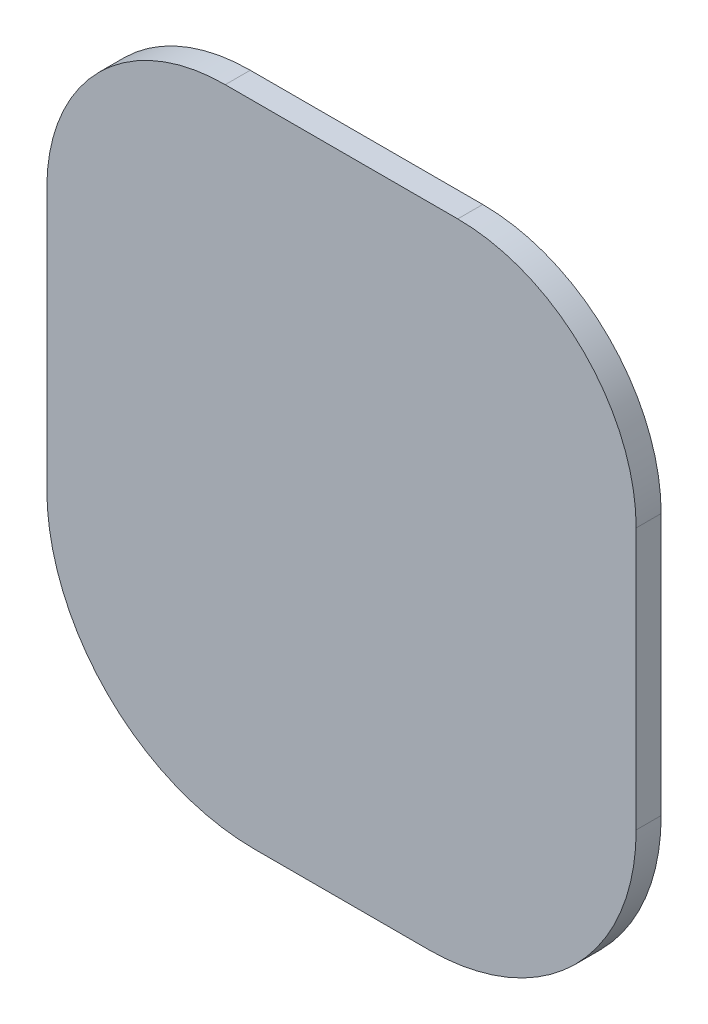
ISO-10303-21;
HEADER;
FILE_DESCRIPTION(('STEP AP214'),'2;1');
FILE_NAME('part.step','',(''),(''),'','','');
FILE_SCHEMA(('AUTOMOTIVE_DESIGN { 1 0 10303 214 1 1 1 1 }'));
ENDSEC;
DATA;
#1=APPLICATION_CONTEXT('core data for automotive mechanical design processes');
#2=APPLICATION_PROTOCOL_DEFINITION('international standard','automotive_design',2000,#1);
#3=PRODUCT_CONTEXT('',#1,'mechanical');
#4=PRODUCT('Part','Part','',(#3));
#5=PRODUCT_RELATED_PRODUCT_CATEGORY('part','',(#4));
#6=PRODUCT_DEFINITION_FORMATION('','',#4);
#7=PRODUCT_DEFINITION_CONTEXT('part definition',#1,'design');
#8=PRODUCT_DEFINITION('design','',#6,#7);
#9=PRODUCT_DEFINITION_SHAPE('','',#8);
#10=(LENGTH_UNIT() NAMED_UNIT(*) SI_UNIT(.MILLI.,.METRE.));
#11=(NAMED_UNIT(*) PLANE_ANGLE_UNIT() SI_UNIT($,.RADIAN.));
#12=(NAMED_UNIT(*) SI_UNIT($,.STERADIAN.) SOLID_ANGLE_UNIT());
#13=UNCERTAINTY_MEASURE_WITH_UNIT(LENGTH_MEASURE(1.E-05),#10,'distance_accuracy_value','');
#14=(GEOMETRIC_REPRESENTATION_CONTEXT(3) GLOBAL_UNCERTAINTY_ASSIGNED_CONTEXT((#13)) GLOBAL_UNIT_ASSIGNED_CONTEXT((#10,
#11,#12)) REPRESENTATION_CONTEXT('',''));
#15=CARTESIAN_POINT('',(0.,0.,0.));
#16=DIRECTION('',(0.,0.,1.));
#17=DIRECTION('',(1.,0.,0.));
#18=AXIS2_PLACEMENT_3D('',#15,#16,#17);
#19=CARTESIAN_POINT('',(-20.,17.,4.3));
#20=DIRECTION('',(0.,0.,-1.));
#21=DIRECTION('',(-1.,0.,0.));
#22=AXIS2_PLACEMENT_3D('',#19,#20,#21);
#23=CYLINDRICAL_SURFACE('',#22,30.7);
#24=CARTESIAN_POINT('',(-20.,17.,0.));
#25=DIRECTION('',(0.,0.,1.));
#26=DIRECTION('',(-1.,0.,0.));
#27=AXIS2_PLACEMENT_3D('',#24,#25,#26);
#28=CIRCLE('',#27,30.7);
#29=CARTESIAN_POINT('',(-20.,47.7,0.));
#30=VERTEX_POINT('',#29);
#31=CARTESIAN_POINT('',(-50.7,17.,0.));
#32=VERTEX_POINT('',#31);
#33=EDGE_CURVE('E144',#30,#32,#28,.T.);
#34=ORIENTED_EDGE('',*,*,#33,.T.);
#35=DIRECTION('',(0.,0.,-1.));
#36=VECTOR('',#35,1.);
#37=CARTESIAN_POINT('',(-50.7,17.,4.3));
#38=LINE('',#37,#36);
#39=CARTESIAN_POINT('',(-50.7,17.,4.3));
#40=VERTEX_POINT('',#39);
#41=EDGE_CURVE('E11',#40,#32,#38,.T.);
#42=ORIENTED_EDGE('',*,*,#41,.F.);
#43=CARTESIAN_POINT('',(-20.,17.,4.3));
#44=DIRECTION('',(0.,0.,1.));
#45=DIRECTION('',(-1.,0.,0.));
#46=AXIS2_PLACEMENT_3D('',#43,#44,#45);
#47=CIRCLE('',#46,30.7);
#48=CARTESIAN_POINT('',(-20.,47.7,4.3));
#49=VERTEX_POINT('',#48);
#50=EDGE_CURVE('E167',#49,#40,#47,.T.);
#51=ORIENTED_EDGE('',*,*,#50,.F.);
#52=DIRECTION('',(0.,0.,-1.));
#53=VECTOR('',#52,1.);
#54=CARTESIAN_POINT('',(-20.,47.7,4.3));
#55=LINE('',#54,#53);
#56=EDGE_CURVE('E140',#49,#30,#55,.T.);
#57=ORIENTED_EDGE('',*,*,#56,.T.);
#58=EDGE_LOOP('',(#34,#42,#51,#57));
#59=FACE_BOUND('',#58,.T.);
#60=ADVANCED_FACE('F43',(#59),#23,.T.);
#61=CARTESIAN_POINT('',(-50.7,17.,4.3));
#62=DIRECTION('',(1.,0.,0.));
#63=DIRECTION('',(0.,1.,0.));
#64=AXIS2_PLACEMENT_3D('',#61,#62,#63);
#65=PLANE('',#64);
#66=DIRECTION('',(0.,-1.,0.));
#67=VECTOR('',#66,1.);
#68=CARTESIAN_POINT('',(-50.7,17.,0.));
#69=LINE('',#68,#67);
#70=CARTESIAN_POINT('',(-50.7,-28.,0.));
#71=VERTEX_POINT('',#70);
#72=EDGE_CURVE('E148',#32,#71,#69,.T.);
#73=ORIENTED_EDGE('',*,*,#72,.T.);
#74=DIRECTION('',(0.,0.,-1.));
#75=VECTOR('',#74,1.);
#76=CARTESIAN_POINT('',(-50.7,-28.,4.3));
#77=LINE('',#76,#75);
#78=CARTESIAN_POINT('',(-50.7,-28.,4.3));
#79=VERTEX_POINT('',#78);
#80=EDGE_CURVE('E52',#79,#71,#77,.T.);
#81=ORIENTED_EDGE('',*,*,#80,.F.);
#82=DIRECTION('',(0.,-1.,0.));
#83=VECTOR('',#82,1.);
#84=CARTESIAN_POINT('',(-50.7,17.,4.3));
#85=LINE('',#84,#83);
#86=EDGE_CURVE('E103',#40,#79,#85,.T.);
#87=ORIENTED_EDGE('',*,*,#86,.F.);
#88=ORIENTED_EDGE('',*,*,#41,.T.);
#89=EDGE_LOOP('',(#73,#81,#87,#88));
#90=FACE_BOUND('',#89,.T.);
#91=ADVANCED_FACE('F212',(#90),#65,.F.);
#92=CARTESIAN_POINT('',(-15.,-28.,4.3));
#93=DIRECTION('',(0.,0.,-1.));
#94=DIRECTION('',(-1.,0.,0.));
#95=AXIS2_PLACEMENT_3D('',#92,#93,#94);
#96=CYLINDRICAL_SURFACE('',#95,35.7);
#97=CARTESIAN_POINT('',(-15.,-28.,0.));
#98=DIRECTION('',(0.,0.,1.));
#99=DIRECTION('',(1.,0.,0.));
#100=AXIS2_PLACEMENT_3D('',#97,#98,#99);
#101=CIRCLE('',#100,35.7);
#102=CARTESIAN_POINT('',(-15.,-63.7,0.));
#103=VERTEX_POINT('',#102);
#104=EDGE_CURVE('E151',#71,#103,#101,.T.);
#105=ORIENTED_EDGE('',*,*,#104,.T.);
#106=DIRECTION('',(0.,0.,-1.));
#107=VECTOR('',#106,1.);
#108=CARTESIAN_POINT('',(-15.,-63.7,4.3));
#109=LINE('',#108,#107);
#110=CARTESIAN_POINT('',(-15.,-63.7,4.3));
#111=VERTEX_POINT('',#110);
#112=EDGE_CURVE('E178',#111,#103,#109,.T.);
#113=ORIENTED_EDGE('',*,*,#112,.F.);
#114=CARTESIAN_POINT('',(-15.,-28.,4.3));
#115=DIRECTION('',(0.,0.,1.));
#116=DIRECTION('',(1.,0.,0.));
#117=AXIS2_PLACEMENT_3D('',#114,#115,#116);
#118=CIRCLE('',#117,35.7);
#119=EDGE_CURVE('E188',#79,#111,#118,.T.);
#120=ORIENTED_EDGE('',*,*,#119,.F.);
#121=ORIENTED_EDGE('',*,*,#80,.T.);
#122=EDGE_LOOP('',(#105,#113,#120,#121));
#123=FACE_BOUND('',#122,.T.);
#124=ADVANCED_FACE('F186',(#123),#96,.T.);
#125=CARTESIAN_POINT('',(0.500000000000017,-63.7,4.3));
#126=DIRECTION('',(0.,1.,0.));
#127=DIRECTION('',(0.,0.,1.));
#128=AXIS2_PLACEMENT_3D('',#125,#126,#127);
#129=PLANE('',#128);
#130=DIRECTION('',(1.,0.,0.));
#131=VECTOR('',#130,1.);
#132=CARTESIAN_POINT('',(0.500000000000017,-63.7,0.));
#133=LINE('',#132,#131);
#134=CARTESIAN_POINT('',(15.,-63.7,0.));
#135=VERTEX_POINT('',#134);
#136=EDGE_CURVE('E155',#103,#135,#133,.T.);
#137=ORIENTED_EDGE('',*,*,#136,.T.);
#138=DIRECTION('',(0.,0.,-1.));
#139=VECTOR('',#138,1.);
#140=CARTESIAN_POINT('',(15.,-63.7,4.3));
#141=LINE('',#140,#139);
#142=CARTESIAN_POINT('',(15.,-63.7,4.3));
#143=VERTEX_POINT('',#142);
#144=EDGE_CURVE('E174',#143,#135,#141,.T.);
#145=ORIENTED_EDGE('',*,*,#144,.F.);
#146=DIRECTION('',(1.,0.,0.));
#147=VECTOR('',#146,1.);
#148=CARTESIAN_POINT('',(-15.,-63.7,4.3));
#149=LINE('',#148,#147);
#150=EDGE_CURVE('E200',#111,#143,#149,.T.);
#151=ORIENTED_EDGE('',*,*,#150,.F.);
#152=ORIENTED_EDGE('',*,*,#112,.T.);
#153=EDGE_LOOP('',(#137,#145,#151,#152));
#154=FACE_BOUND('',#153,.T.);
#155=ADVANCED_FACE('F195',(#154),#129,.F.);
#156=CARTESIAN_POINT('',(15.,-28.,4.3));
#157=DIRECTION('',(0.,0.,-1.));
#158=DIRECTION('',(-1.,0.,0.));
#159=AXIS2_PLACEMENT_3D('',#156,#157,#158);
#160=CYLINDRICAL_SURFACE('',#159,35.7);
#161=CARTESIAN_POINT('',(15.,-28.,0.));
#162=DIRECTION('',(0.,0.,1.));
#163=DIRECTION('',(1.,0.,0.));
#164=AXIS2_PLACEMENT_3D('',#161,#162,#163);
#165=CIRCLE('',#164,35.7);
#166=CARTESIAN_POINT('',(50.7,-28.,0.));
#167=VERTEX_POINT('',#166);
#168=EDGE_CURVE('E158',#135,#167,#165,.T.);
#169=ORIENTED_EDGE('',*,*,#168,.T.);
#170=DIRECTION('',(0.,0.,-1.));
#171=VECTOR('',#170,1.);
#172=CARTESIAN_POINT('',(50.7,-28.,4.3));
#173=LINE('',#172,#171);
#174=CARTESIAN_POINT('',(50.7,-28.,4.3));
#175=VERTEX_POINT('',#174);
#176=EDGE_CURVE('E133',#175,#167,#173,.T.);
#177=ORIENTED_EDGE('',*,*,#176,.F.);
#178=CARTESIAN_POINT('',(15.,-28.,4.3));
#179=DIRECTION('',(0.,0.,1.));
#180=DIRECTION('',(1.,0.,0.));
#181=AXIS2_PLACEMENT_3D('',#178,#179,#180);
#182=CIRCLE('',#181,35.7);
#183=EDGE_CURVE('E122',#143,#175,#182,.T.);
#184=ORIENTED_EDGE('',*,*,#183,.F.);
#185=ORIENTED_EDGE('',*,*,#144,.T.);
#186=EDGE_LOOP('',(#169,#177,#184,#185));
#187=FACE_BOUND('',#186,.T.);
#188=ADVANCED_FACE('F198',(#187),#160,.T.);
#189=CARTESIAN_POINT('',(50.7,17.,4.3));
#190=DIRECTION('',(-1.,0.,0.));
#191=DIRECTION('',(0.,-1.,0.));
#192=AXIS2_PLACEMENT_3D('',#189,#190,#191);
#193=PLANE('',#192);
#194=DIRECTION('',(0.,1.,0.));
#195=VECTOR('',#194,1.);
#196=CARTESIAN_POINT('',(50.7,17.,0.));
#197=LINE('',#196,#195);
#198=CARTESIAN_POINT('',(50.7,17.,0.));
#199=VERTEX_POINT('',#198);
#200=EDGE_CURVE('E131',#167,#199,#197,.T.);
#201=ORIENTED_EDGE('',*,*,#200,.T.);
#202=DIRECTION('',(0.,0.,-1.));
#203=VECTOR('',#202,1.);
#204=CARTESIAN_POINT('',(50.7,17.,4.3));
#205=LINE('',#204,#203);
#206=CARTESIAN_POINT('',(50.7,17.,4.3));
#207=VERTEX_POINT('',#206);
#208=EDGE_CURVE('E128',#207,#199,#205,.T.);
#209=ORIENTED_EDGE('',*,*,#208,.F.);
#210=DIRECTION('',(0.,1.,0.));
#211=VECTOR('',#210,1.);
#212=CARTESIAN_POINT('',(50.7,17.,4.3));
#213=LINE('',#212,#211);
#214=EDGE_CURVE('E116',#175,#207,#213,.T.);
#215=ORIENTED_EDGE('',*,*,#214,.F.);
#216=ORIENTED_EDGE('',*,*,#176,.T.);
#217=EDGE_LOOP('',(#201,#209,#215,#216));
#218=FACE_BOUND('',#217,.T.);
#219=ADVANCED_FACE('F129',(#218),#193,.F.);
#220=CARTESIAN_POINT('',(20.,17.,4.3));
#221=DIRECTION('',(0.,0.,-1.));
#222=DIRECTION('',(-1.,0.,0.));
#223=AXIS2_PLACEMENT_3D('',#220,#221,#222);
#224=CYLINDRICAL_SURFACE('',#223,30.7);
#225=CARTESIAN_POINT('',(20.,17.,0.));
#226=DIRECTION('',(0.,0.,1.));
#227=DIRECTION('',(-1.,0.,0.));
#228=AXIS2_PLACEMENT_3D('',#225,#226,#227);
#229=CIRCLE('',#228,30.7);
#230=CARTESIAN_POINT('',(20.,47.7,0.));
#231=VERTEX_POINT('',#230);
#232=EDGE_CURVE('E89',#199,#231,#229,.T.);
#233=ORIENTED_EDGE('',*,*,#232,.T.);
#234=DIRECTION('',(0.,0.,-1.));
#235=VECTOR('',#234,1.);
#236=CARTESIAN_POINT('',(20.,47.7,4.3));
#237=LINE('',#236,#235);
#238=CARTESIAN_POINT('',(20.,47.7,4.3));
#239=VERTEX_POINT('',#238);
#240=EDGE_CURVE('E134',#239,#231,#237,.T.);
#241=ORIENTED_EDGE('',*,*,#240,.F.);
#242=CARTESIAN_POINT('',(20.,17.,4.3));
#243=DIRECTION('',(0.,0.,1.));
#244=DIRECTION('',(-1.,0.,0.));
#245=AXIS2_PLACEMENT_3D('',#242,#243,#244);
#246=CIRCLE('',#245,30.7);
#247=EDGE_CURVE('E120',#207,#239,#246,.T.);
#248=ORIENTED_EDGE('',*,*,#247,.F.);
#249=ORIENTED_EDGE('',*,*,#208,.T.);
#250=EDGE_LOOP('',(#233,#241,#248,#249));
#251=FACE_BOUND('',#250,.T.);
#252=ADVANCED_FACE('F136',(#251),#224,.T.);
#253=CARTESIAN_POINT('',(-20.,47.7,4.3));
#254=DIRECTION('',(0.,-1.,0.));
#255=DIRECTION('',(1.,0.,0.));
#256=AXIS2_PLACEMENT_3D('',#253,#254,#255);
#257=PLANE('',#256);
#258=DIRECTION('',(-1.,0.,0.));
#259=VECTOR('',#258,1.);
#260=CARTESIAN_POINT('',(-20.,47.7,0.));
#261=LINE('',#260,#259);
#262=EDGE_CURVE('E95',#231,#30,#261,.T.);
#263=ORIENTED_EDGE('',*,*,#262,.T.);
#264=ORIENTED_EDGE('',*,*,#56,.F.);
#265=DIRECTION('',(-1.,0.,0.));
#266=VECTOR('',#265,1.);
#267=CARTESIAN_POINT('',(-20.,47.7,4.3));
#268=LINE('',#267,#266);
#269=EDGE_CURVE('E60',#239,#49,#268,.T.);
#270=ORIENTED_EDGE('',*,*,#269,.F.);
#271=ORIENTED_EDGE('',*,*,#240,.T.);
#272=EDGE_LOOP('',(#263,#264,#270,#271));
#273=FACE_BOUND('',#272,.T.);
#274=ADVANCED_FACE('F228',(#273),#257,.F.);
#275=CARTESIAN_POINT('',(-20.,17.,4.3));
#276=DIRECTION('',(0.,0.,-1.));
#277=DIRECTION('',(-1.,0.,0.));
#278=AXIS2_PLACEMENT_3D('',#275,#276,#277);
#279=PLANE('',#278);
#280=ORIENTED_EDGE('',*,*,#50,.T.);
#281=ORIENTED_EDGE('',*,*,#86,.T.);
#282=ORIENTED_EDGE('',*,*,#119,.T.);
#283=ORIENTED_EDGE('',*,*,#150,.T.);
#284=ORIENTED_EDGE('',*,*,#183,.T.);
#285=ORIENTED_EDGE('',*,*,#214,.T.);
#286=ORIENTED_EDGE('',*,*,#247,.T.);
#287=ORIENTED_EDGE('',*,*,#269,.T.);
#288=EDGE_LOOP('',(#280,#281,#282,#283,#284,#285,#286,#287));
#289=FACE_BOUND('',#288,.T.);
#290=ADVANCED_FACE('F118',(#289),#279,.F.);
#291=CARTESIAN_POINT('',(-20.,17.,0.));
#292=DIRECTION('',(0.,0.,-1.));
#293=DIRECTION('',(-1.,0.,0.));
#294=AXIS2_PLACEMENT_3D('',#291,#292,#293);
#295=PLANE('',#294);
#296=ORIENTED_EDGE('',*,*,#33,.F.);
#297=ORIENTED_EDGE('',*,*,#262,.F.);
#298=ORIENTED_EDGE('',*,*,#232,.F.);
#299=ORIENTED_EDGE('',*,*,#200,.F.);
#300=ORIENTED_EDGE('',*,*,#168,.F.);
#301=ORIENTED_EDGE('',*,*,#136,.F.);
#302=ORIENTED_EDGE('',*,*,#104,.F.);
#303=ORIENTED_EDGE('',*,*,#72,.F.);
#304=EDGE_LOOP('',(#296,#297,#298,#299,#300,#301,#302,#303));
#305=FACE_BOUND('',#304,.T.);
#306=ADVANCED_FACE('F191',(#305),#295,.T.);
#307=CLOSED_SHELL('',(#60,#91,#124,#155,#188,#219,#252,#274,#290,#306));
#308=MANIFOLD_SOLID_BREP('B2',#307);
#309=ADVANCED_BREP_SHAPE_REPRESENTATION('',(#18,#308),#14);
#310=SHAPE_DEFINITION_REPRESENTATION(#9,#309);
ENDSEC;
END-ISO-10303-21;
